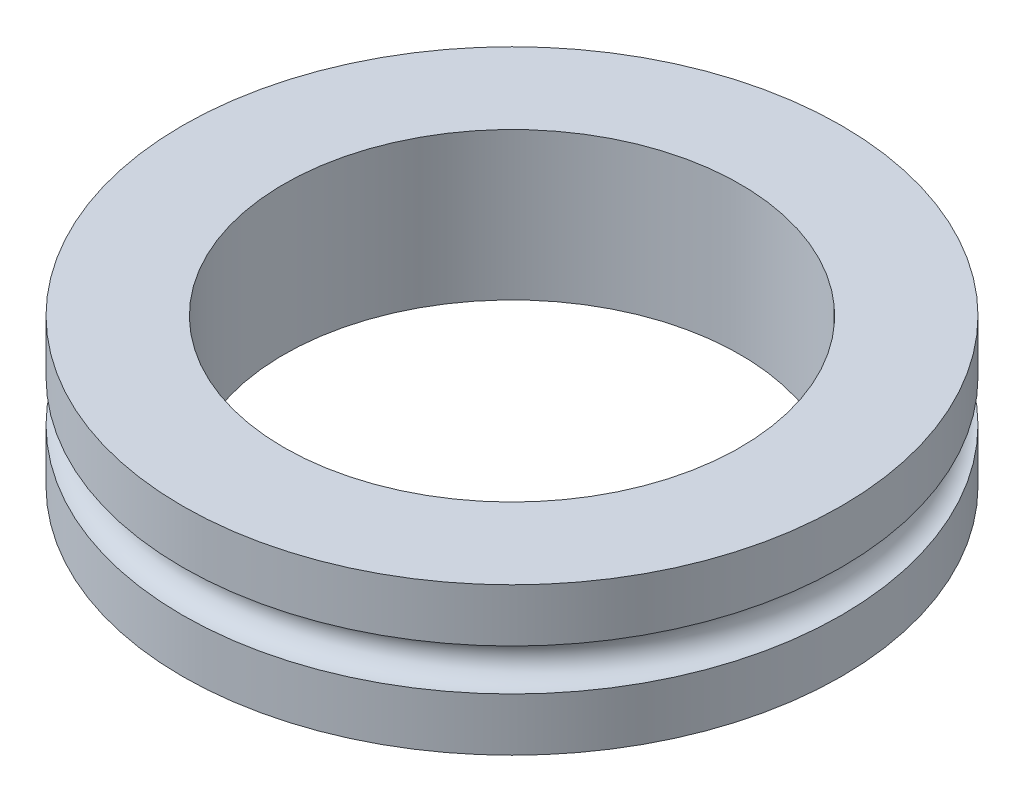
ISO-10303-21;
HEADER;
FILE_DESCRIPTION(('STEP AP214'),'2;1');
FILE_NAME('part.step','',(''),(''),'','','');
FILE_SCHEMA(('AUTOMOTIVE_DESIGN { 1 0 10303 214 1 1 1 1 }'));
ENDSEC;
DATA;
#1=APPLICATION_CONTEXT('core data for automotive mechanical design processes');
#2=APPLICATION_PROTOCOL_DEFINITION('international standard','automotive_design',2000,#1);
#3=PRODUCT_CONTEXT('',#1,'mechanical');
#4=PRODUCT('Part','Part','',(#3));
#5=PRODUCT_RELATED_PRODUCT_CATEGORY('part','',(#4));
#6=PRODUCT_DEFINITION_FORMATION('','',#4);
#7=PRODUCT_DEFINITION_CONTEXT('part definition',#1,'design');
#8=PRODUCT_DEFINITION('design','',#6,#7);
#9=PRODUCT_DEFINITION_SHAPE('','',#8);
#10=(LENGTH_UNIT() NAMED_UNIT(*) SI_UNIT(.MILLI.,.METRE.));
#11=(NAMED_UNIT(*) PLANE_ANGLE_UNIT() SI_UNIT($,.RADIAN.));
#12=(NAMED_UNIT(*) SI_UNIT($,.STERADIAN.) SOLID_ANGLE_UNIT());
#13=UNCERTAINTY_MEASURE_WITH_UNIT(LENGTH_MEASURE(1.E-05),#10,'distance_accuracy_value','');
#14=(GEOMETRIC_REPRESENTATION_CONTEXT(3) GLOBAL_UNCERTAINTY_ASSIGNED_CONTEXT((#13)) GLOBAL_UNIT_ASSIGNED_CONTEXT((#10,
#11,#12)) REPRESENTATION_CONTEXT('',''));
#15=CARTESIAN_POINT('',(0.,0.,0.));
#16=DIRECTION('',(0.,0.,1.));
#17=DIRECTION('',(1.,0.,0.));
#18=AXIS2_PLACEMENT_3D('',#15,#16,#17);
#19=CARTESIAN_POINT('',(0.,7.112,0.));
#20=DIRECTION('',(0.,-1.,0.));
#21=DIRECTION('',(0.,0.,-1.));
#22=AXIS2_PLACEMENT_3D('',#19,#20,#21);
#23=CYLINDRICAL_SURFACE('',#22,15.875);
#24=CARTESIAN_POINT('',(0.,4.556,0.));
#25=DIRECTION('',(0.,1.,0.));
#26=DIRECTION('',(0.,0.,1.));
#27=AXIS2_PLACEMENT_3D('',#24,#25,#26);
#28=CIRCLE('',#27,15.875);
#29=CARTESIAN_POINT('',(0.,4.556,15.875));
#30=VERTEX_POINT('',#29);
#31=EDGE_CURVE('E48',#30,#30,#28,.T.);
#32=ORIENTED_EDGE('',*,*,#31,.T.);
#33=EDGE_LOOP('',(#32));
#34=FACE_BOUND('',#33,.T.);
#35=CARTESIAN_POINT('',(0.,7.112,0.));
#36=DIRECTION('',(0.,1.,0.));
#37=DIRECTION('',(0.,0.,1.));
#38=AXIS2_PLACEMENT_3D('',#35,#36,#37);
#39=CIRCLE('',#38,15.875);
#40=CARTESIAN_POINT('',(0.,7.112,15.875));
#41=VERTEX_POINT('',#40);
#42=EDGE_CURVE('E10',#41,#41,#39,.T.);
#43=ORIENTED_EDGE('',*,*,#42,.F.);
#44=EDGE_LOOP('',(#43));
#45=FACE_BOUND('',#44,.T.);
#46=ADVANCED_FACE('F31',(#34,#45),#23,.T.);
#47=CARTESIAN_POINT('',(0.,7.112,0.));
#48=DIRECTION('',(0.,1.,0.));
#49=DIRECTION('',(0.,0.,1.));
#50=AXIS2_PLACEMENT_3D('',#47,#48,#49);
#51=PLANE('',#50);
#52=CARTESIAN_POINT('',(0.,7.112,0.));
#53=DIRECTION('',(0.,1.,0.));
#54=DIRECTION('',(0.,0.,1.));
#55=AXIS2_PLACEMENT_3D('',#52,#53,#54);
#56=CIRCLE('',#55,10.99185);
#57=CARTESIAN_POINT('',(0.,7.112,10.99185));
#58=VERTEX_POINT('',#57);
#59=EDGE_CURVE('E51',#58,#58,#56,.T.);
#60=ORIENTED_EDGE('',*,*,#59,.F.);
#61=EDGE_LOOP('',(#60));
#62=FACE_BOUND('',#61,.T.);
#63=ORIENTED_EDGE('',*,*,#42,.T.);
#64=EDGE_LOOP('',(#63));
#65=FACE_BOUND('',#64,.T.);
#66=ADVANCED_FACE('F70',(#62,#65),#51,.T.);
#67=CARTESIAN_POINT('',(0.,3.556,0.));
#68=DIRECTION('',(0.,1.,0.));
#69=DIRECTION('',(0.,0.,1.));
#70=AXIS2_PLACEMENT_3D('',#67,#68,#69);
#71=TOROIDAL_SURFACE('',#70,15.875,1.);
#72=ORIENTED_EDGE('',*,*,#31,.F.);
#73=EDGE_LOOP('',(#72));
#74=FACE_BOUND('',#73,.T.);
#75=CARTESIAN_POINT('',(0.,2.556,0.));
#76=DIRECTION('',(0.,1.,0.));
#77=DIRECTION('',(0.,0.,1.));
#78=AXIS2_PLACEMENT_3D('',#75,#76,#77);
#79=CIRCLE('',#78,15.875);
#80=CARTESIAN_POINT('',(0.,2.556,15.875));
#81=VERTEX_POINT('',#80);
#82=EDGE_CURVE('E44',#81,#81,#79,.T.);
#83=ORIENTED_EDGE('',*,*,#82,.T.);
#84=EDGE_LOOP('',(#83));
#85=FACE_BOUND('',#84,.T.);
#86=ADVANCED_FACE('F75',(#74,#85),#71,.F.);
#87=CARTESIAN_POINT('',(0.,0.,0.));
#88=DIRECTION('',(0.,1.,0.));
#89=DIRECTION('',(0.,0.,1.));
#90=AXIS2_PLACEMENT_3D('',#87,#88,#89);
#91=PLANE('',#90);
#92=CARTESIAN_POINT('',(0.,0.,0.));
#93=DIRECTION('',(0.,1.,0.));
#94=DIRECTION('',(0.,0.,1.));
#95=AXIS2_PLACEMENT_3D('',#92,#93,#94);
#96=CIRCLE('',#95,10.99185);
#97=CARTESIAN_POINT('',(0.,0.,10.99185));
#98=VERTEX_POINT('',#97);
#99=EDGE_CURVE('E35',#98,#98,#96,.T.);
#100=ORIENTED_EDGE('',*,*,#99,.T.);
#101=EDGE_LOOP('',(#100));
#102=FACE_BOUND('',#101,.T.);
#103=CARTESIAN_POINT('',(0.,0.,0.));
#104=DIRECTION('',(0.,1.,0.));
#105=DIRECTION('',(0.,0.,1.));
#106=AXIS2_PLACEMENT_3D('',#103,#104,#105);
#107=CIRCLE('',#106,15.875);
#108=CARTESIAN_POINT('',(0.,0.,15.875));
#109=VERTEX_POINT('',#108);
#110=EDGE_CURVE('E39',#109,#109,#107,.T.);
#111=ORIENTED_EDGE('',*,*,#110,.F.);
#112=EDGE_LOOP('',(#111));
#113=FACE_BOUND('',#112,.T.);
#114=ADVANCED_FACE('F58',(#102,#113),#91,.F.);
#115=ORIENTED_EDGE('',*,*,#82,.F.);
#116=EDGE_LOOP('',(#115));
#117=FACE_BOUND('',#116,.T.);
#118=ORIENTED_EDGE('',*,*,#110,.T.);
#119=EDGE_LOOP('',(#118));
#120=FACE_BOUND('',#119,.T.);
#121=ADVANCED_FACE('F33',(#117,#120),#23,.T.);
#122=CARTESIAN_POINT('',(0.,-3.048,0.));
#123=DIRECTION('',(0.,1.,0.));
#124=DIRECTION('',(0.,0.,1.));
#125=AXIS2_PLACEMENT_3D('',#122,#123,#124);
#126=CYLINDRICAL_SURFACE('',#125,10.99185);
#127=ORIENTED_EDGE('',*,*,#59,.T.);
#128=EDGE_LOOP('',(#127));
#129=FACE_BOUND('',#128,.T.);
#130=ORIENTED_EDGE('',*,*,#99,.F.);
#131=EDGE_LOOP('',(#130));
#132=FACE_BOUND('',#131,.T.);
#133=ADVANCED_FACE('F61',(#129,#132),#126,.F.);
#134=CLOSED_SHELL('',(#46,#66,#86,#114,#121,#133));
#135=MANIFOLD_SOLID_BREP('B2',#134);
#136=ADVANCED_BREP_SHAPE_REPRESENTATION('',(#18,#135),#14);
#137=SHAPE_DEFINITION_REPRESENTATION(#9,#136);
ENDSEC;
END-ISO-10303-21;
